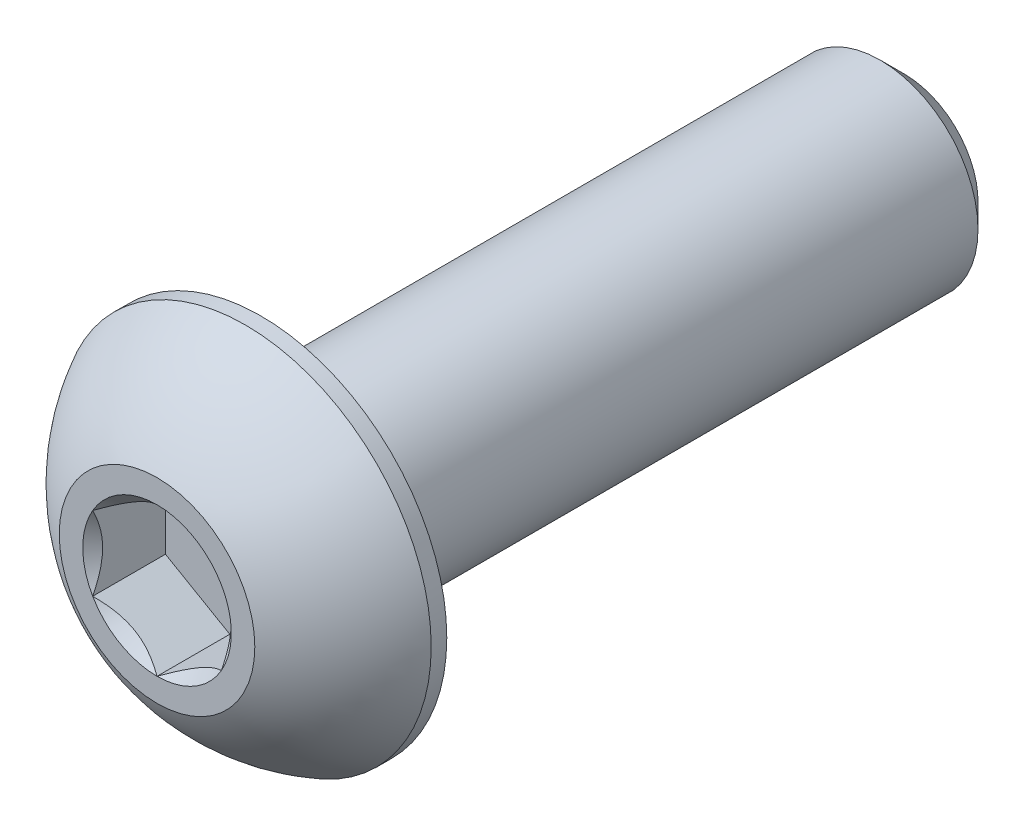
ISO-10303-21;
HEADER;
FILE_DESCRIPTION(('STEP AP214'),'2;1');
FILE_NAME('part.step','',(''),(''),'','','');
FILE_SCHEMA(('AUTOMOTIVE_DESIGN { 1 0 10303 214 1 1 1 1 }'));
ENDSEC;
DATA;
#1=APPLICATION_CONTEXT('core data for automotive mechanical design processes');
#2=APPLICATION_PROTOCOL_DEFINITION('international standard','automotive_design',2000,#1);
#3=PRODUCT_CONTEXT('',#1,'mechanical');
#4=PRODUCT('Part','Part','',(#3));
#5=PRODUCT_RELATED_PRODUCT_CATEGORY('part','',(#4));
#6=PRODUCT_DEFINITION_FORMATION('','',#4);
#7=PRODUCT_DEFINITION_CONTEXT('part definition',#1,'design');
#8=PRODUCT_DEFINITION('design','',#6,#7);
#9=PRODUCT_DEFINITION_SHAPE('','',#8);
#10=(LENGTH_UNIT() NAMED_UNIT(*) SI_UNIT(.MILLI.,.METRE.));
#11=(NAMED_UNIT(*) PLANE_ANGLE_UNIT() SI_UNIT($,.RADIAN.));
#12=(NAMED_UNIT(*) SI_UNIT($,.STERADIAN.) SOLID_ANGLE_UNIT());
#13=UNCERTAINTY_MEASURE_WITH_UNIT(LENGTH_MEASURE(1.E-05),#10,'distance_accuracy_value','');
#14=(GEOMETRIC_REPRESENTATION_CONTEXT(3) GLOBAL_UNCERTAINTY_ASSIGNED_CONTEXT((#13)) GLOBAL_UNIT_ASSIGNED_CONTEXT((#10,
#11,#12)) REPRESENTATION_CONTEXT('',''));
#15=CARTESIAN_POINT('',(0.,0.,0.));
#16=DIRECTION('',(0.,0.,1.));
#17=DIRECTION('',(1.,0.,0.));
#18=AXIS2_PLACEMENT_3D('',#15,#16,#17);
#19=CARTESIAN_POINT('',(0.,-2.41300000000001,-18.4404));
#20=DIRECTION('',(0.,0.,-1.));
#21=DIRECTION('',(0.,1.,0.));
#22=AXIS2_PLACEMENT_3D('',#19,#20,#21);
#23=PLANE('',#22);
#24=CARTESIAN_POINT('',(0.,0.,-18.4404));
#25=DIRECTION('',(0.,0.,-1.));
#26=DIRECTION('',(0.,1.,0.));
#27=AXIS2_PLACEMENT_3D('',#24,#25,#26);
#28=CIRCLE('',#27,1.8176875);
#29=CARTESIAN_POINT('',(0.,1.8176875,-18.4404));
#30=VERTEX_POINT('',#29);
#31=EDGE_CURVE('E42',#30,#30,#28,.T.);
#32=ORIENTED_EDGE('',*,*,#31,.T.);
#33=EDGE_LOOP('',(#32));
#34=FACE_BOUND('',#33,.T.);
#35=ADVANCED_FACE('F34',(#34),#23,.T.);
#36=CARTESIAN_POINT('',(0.,0.,-18.4404));
#37=DIRECTION('',(0.,0.,-1.));
#38=DIRECTION('',(0.,1.,0.));
#39=AXIS2_PLACEMENT_3D('',#36,#37,#38);
#40=CYLINDRICAL_SURFACE('',#39,2.413);
#41=CARTESIAN_POINT('',(0.,0.,-17.8450875));
#42=DIRECTION('',(0.,0.,-1.));
#43=DIRECTION('',(0.,1.,0.));
#44=AXIS2_PLACEMENT_3D('',#41,#42,#43);
#45=CIRCLE('',#44,2.413);
#46=CARTESIAN_POINT('',(0.,2.413,-17.8450875));
#47=VERTEX_POINT('',#46);
#48=EDGE_CURVE('E11',#47,#47,#45,.F.);
#49=ORIENTED_EDGE('',*,*,#48,.T.);
#50=EDGE_LOOP('',(#49));
#51=FACE_BOUND('',#50,.T.);
#52=CARTESIAN_POINT('',(0.,0.,-2.5654));
#53=DIRECTION('',(0.,0.,1.));
#54=DIRECTION('',(1.,0.,0.));
#55=AXIS2_PLACEMENT_3D('',#52,#53,#54);
#56=CIRCLE('',#55,2.413);
#57=CARTESIAN_POINT('',(2.413,0.,-2.5654));
#58=VERTEX_POINT('',#57);
#59=EDGE_CURVE('E168',#58,#58,#56,.F.);
#60=ORIENTED_EDGE('',*,*,#59,.T.);
#61=EDGE_LOOP('',(#60));
#62=FACE_BOUND('',#61,.T.);
#63=ADVANCED_FACE('F176',(#51,#62),#40,.T.);
#64=CARTESIAN_POINT('',(0.,0.,-18.4404));
#65=DIRECTION('',(0.,0.,1.));
#66=DIRECTION('',(0.,-1.,0.));
#67=AXIS2_PLACEMENT_3D('',#64,#65,#66);
#68=CONICAL_SURFACE('',#67,1.8176875,0.785398163397443);
#69=ORIENTED_EDGE('',*,*,#48,.F.);
#70=EDGE_LOOP('',(#69));
#71=FACE_BOUND('',#70,.T.);
#72=ORIENTED_EDGE('',*,*,#31,.F.);
#73=EDGE_LOOP('',(#72));
#74=FACE_BOUND('',#73,.T.);
#75=ADVANCED_FACE('F36',(#71,#74),#68,.T.);
#76=CARTESIAN_POINT('',(0.,0.,-4.5748806144438));
#77=DIRECTION('',(0.,0.,1.));
#78=DIRECTION('',(0.,-1.,0.));
#79=AXIS2_PLACEMENT_3D('',#76,#77,#78);
#80=SPHERICAL_SURFACE('',#79,5.17224338526463);
#81=CARTESIAN_POINT('',(0.,0.,0.));
#82=DIRECTION('',(0.,0.,1.));
#83=DIRECTION('',(1.,0.,0.));
#84=AXIS2_PLACEMENT_3D('',#81,#82,#83);
#85=CIRCLE('',#84,2.413);
#86=CARTESIAN_POINT('',(0.,-2.413,0.));
#87=VERTEX_POINT('',#86);
#88=EDGE_CURVE('E165',#87,#87,#85,.T.);
#89=CARTESIAN_POINT('',(0.,0.,-2.18059));
#90=DIRECTION('',(0.,0.,1.));
#91=DIRECTION('',(1.,0.,0.));
#92=AXIS2_PLACEMENT_3D('',#89,#90,#91);
#93=CIRCLE('',#92,4.5847);
#94=CARTESIAN_POINT('',(0.,-4.5847,-2.18059));
#95=VERTEX_POINT('',#94);
#96=EDGE_CURVE('E159',#95,#95,#93,.T.);
#97=CARTESIAN_POINT('',(0.,-2.413,0.));
#98=CARTESIAN_POINT('',(0.,-2.44179113663083,-0.0151857097788009));
#99=CARTESIAN_POINT('',(0.,-2.47043888331474,-0.0306432741933343));
#100=CARTESIAN_POINT('',(0.,-2.5274374690351,-0.0620964513369402));
#101=CARTESIAN_POINT('',(0.,-2.55578830807155,-0.0780920640660127));
#102=CARTESIAN_POINT('',(0.,-2.61218295074331,-0.110615676881771));
#103=CARTESIAN_POINT('',(0.,-2.64022675437863,-0.127143676968457));
#104=CARTESIAN_POINT('',(0.,-2.69599733629138,-0.160726162390165));
#105=CARTESIAN_POINT('',(0.,-2.72372411456883,-0.177780647725188));
#106=CARTESIAN_POINT('',(0.,-2.77885076121155,-0.21241002764294));
#107=CARTESIAN_POINT('',(0.,-2.80625062957682,-0.229984922225668));
#108=CARTESIAN_POINT('',(0.,-2.86071369040082,-0.265648855453746));
#109=CARTESIAN_POINT('',(0.,-2.88777688285954,-0.283737894099096));
#110=CARTESIAN_POINT('',(0.,-2.94155694533546,-0.320423667994127));
#111=CARTESIAN_POINT('',(0.,-2.96827381535266,-0.339020403243808));
#112=CARTESIAN_POINT('',(0.,-3.02135171000009,-0.37671494166065));
#113=CARTESIAN_POINT('',(0.,-3.04771273463033,-0.39581274482781));
#114=CARTESIAN_POINT('',(0.,-3.10006954235699,-0.434502611862808));
#115=CARTESIAN_POINT('',(0.,-3.12606532545341,-0.454094675730644));
#116=CARTESIAN_POINT('',(0.,-3.17768238416296,-0.493766080756604));
#117=CARTESIAN_POINT('',(0.,-3.20330365977609,-0.513845421914727));
#118=CARTESIAN_POINT('',(0.,-3.25416257105645,-0.554484224430573));
#119=CARTESIAN_POINT('',(0.,-3.27940020672367,-0.575043685788297));
#120=CARTESIAN_POINT('',(0.,-3.32948284239517,-0.616635400476975));
#121=CARTESIAN_POINT('',(0.,-3.35432784239946,-0.63766765380793));
#122=CARTESIAN_POINT('',(0.,-3.40361635097913,-0.680197455694829));
#123=CARTESIAN_POINT('',(0.,-3.42805985955453,-0.701695004250773));
#124=CARTESIAN_POINT('',(0.,-3.47653667261836,-0.745147733989217));
#125=CARTESIAN_POINT('',(0.,-3.5005699771068,-0.767102915171716));
#126=CARTESIAN_POINT('',(0.,-3.54821781555203,-0.81146308444603));
#127=CARTESIAN_POINT('',(0.,-3.57183234950881,-0.833868072537843));
#128=CARTESIAN_POINT('',(0.,-3.61863422971284,-0.879119869584105));
#129=CARTESIAN_POINT('',(0.,-3.64182157596008,-0.901966678538555));
#130=CARTESIAN_POINT('',(0.,-3.68776081583415,-0.948093973780533));
#131=CARTESIAN_POINT('',(0.,-3.71051270946098,-0.971374460068061));
#132=CARTESIAN_POINT('',(0.,-3.75557293439636,-1.01836081186645));
#133=CARTESIAN_POINT('',(0.,-3.7778812657049,-1.0420666773773));
#134=CARTESIAN_POINT('',(0.,-3.82204641440941,-1.08989533789018));
#135=CARTESIAN_POINT('',(0.,-3.84390323180538,-1.11401813289221));
#136=CARTESIAN_POINT('',(0.,-3.88715756202836,-1.16267205404467));
#137=CARTESIAN_POINT('',(0.,-3.90855507485536,-1.18720318019511));
#138=CARTESIAN_POINT('',(0.,-3.95088316899876,-1.23666501975588));
#139=CARTESIAN_POINT('',(0.,-3.97181375031515,-1.26159573316622));
#140=CARTESIAN_POINT('',(0.,-4.01320052092912,-1.31184786092909));
#141=CARTESIAN_POINT('',(0.,-4.03365671022669,-1.33716927528163));
#142=CARTESIAN_POINT('',(0.,-4.07408740538699,-1.38819377934977));
#143=CARTESIAN_POINT('',(0.,-4.09406191124973,-1.41389686906536));
#144=CARTESIAN_POINT('',(0.,-4.13352211981722,-1.46567556223513));
#145=CARTESIAN_POINT('',(0.,-4.15300782252198,-1.4917511656893));
#146=CARTESIAN_POINT('',(0.,-4.19148347927457,-1.54426559193551));
#147=CARTESIAN_POINT('',(0.,-4.2104734333224,-1.57070441472756));
#148=CARTESIAN_POINT('',(0.,-4.24795082398615,-1.6239358557723));
#149=CARTESIAN_POINT('',(0.,-4.26643826060207,-1.65072847402499));
#150=CARTESIAN_POINT('',(0.,-4.30290402667351,-1.70465795604563));
#151=CARTESIAN_POINT('',(0.,-4.32088235612901,-1.73179481981358));
#152=CARTESIAN_POINT('',(0.,-4.35632349988304,-1.78640312007115));
#153=CARTESIAN_POINT('',(0.,-4.37378631418156,-1.81387455656079));
#154=CARTESIAN_POINT('',(0.,-4.40819020238474,-1.86914221075438));
#155=CARTESIAN_POINT('',(0.,-4.42513127628939,-1.89693842845834));
#156=CARTESIAN_POINT('',(0.,-4.45848564813517,-1.95284573578717));
#157=CARTESIAN_POINT('',(0.,-4.4748989460763,-1.98095682541204));
#158=CARTESIAN_POINT('',(0.,-4.50719190474587,-2.03748386259807));
#159=CARTESIAN_POINT('',(0.,-4.5230715654743,-2.06589981015923));
#160=CARTESIAN_POINT('',(0.,-4.55429163018258,-2.12302641242262));
#161=CARTESIAN_POINT('',(0.,-4.56963203416241,-2.15173706712485));
#162=CARTESIAN_POINT('',(0.,-4.5847,-2.18059));
#163=B_SPLINE_CURVE_WITH_KNOTS('',3,(#97,#98,#99,#100,#101,#102,#103,#104,#105,#106,#107,#108,
#109,#110,#111,#112,#113,#114,#115,#116,#117,#118,#119,#120,#121,#122,#123,#124,#125,#126,#127,
#128,#129,#130,#131,#132,#133,#134,#135,#136,#137,#138,#139,#140,#141,#142,#143,#144,#145,#146,
#147,#148,#149,#150,#151,#152,#153,#154,#155,#156,#157,#158,#159,#160,#161,#162),.UNSPECIFIED.,
.F.,.F.,(4,2,2,2,2,2,2,2,2,2,2,2,2,2,2,2,2,2,2,2,2,2,2,2,2,2,2,2,2,2,2,2,4),(0.,
0.0976500604051489,0.195300120810298,0.292950181215447,0.390600241620598,0.488250302025747,
0.585900362430896,0.683550422836046,0.781200483241194,0.878850543646344,0.976500604051493,
1.07415066445664,1.17180072486179,1.26945078526694,1.36710084567209,1.46475090607724,
1.56240096648239,1.66005102688754,1.75770108729269,1.85535114769784,1.95300120810299,
2.05065126850813,2.14830132891329,2.24595138931843,2.34360144972358,2.44125151012873,
2.53890157053388,2.63655163093903,2.73420169134418,2.83185175174933,2.92950181215448,
3.02715187255963,3.12480193296478),.UNSPECIFIED.);
#164=EDGE_CURVE('BSEAM175',#87,#95,#163,.T.);
#165=ORIENTED_EDGE('',*,*,#88,.F.);
#166=ORIENTED_EDGE('',*,*,#96,.T.);
#167=ORIENTED_EDGE('',*,*,#164,.T.);
#168=ORIENTED_EDGE('',*,*,#164,.F.);
#169=EDGE_LOOP('',(#165,#167,#166,#168));
#170=FACE_BOUND('',#169,.T.);
#171=ADVANCED_FACE('F175',(#170),#80,.T.);
#172=CARTESIAN_POINT('',(0.,-2.413,0.));
#173=DIRECTION('',(0.,0.,-1.));
#174=DIRECTION('',(-1.,0.,0.));
#175=AXIS2_PLACEMENT_3D('',#172,#173,#174);
#176=PLANE('',#175);
#177=CARTESIAN_POINT('',(0.,0.,0.));
#178=DIRECTION('',(0.,0.,1.));
#179=DIRECTION('',(1.,0.,0.));
#180=AXIS2_PLACEMENT_3D('',#177,#178,#179);
#181=CIRCLE('',#180,1.83308710467706);
#182=CARTESIAN_POINT('',(-1.5875,0.91654355233853,0.));
#183=VERTEX_POINT('',#182);
#184=CARTESIAN_POINT('',(-1.5875,-0.916543552338532,0.));
#185=VERTEX_POINT('',#184);
#186=EDGE_CURVE('E55',#183,#185,#181,.T.);
#187=ORIENTED_EDGE('',*,*,#186,.F.);
#188=CARTESIAN_POINT('',(0.,1.83308710467706,0.));
#189=VERTEX_POINT('',#188);
#190=EDGE_CURVE('E129',#189,#183,#181,.T.);
#191=ORIENTED_EDGE('',*,*,#190,.F.);
#192=CARTESIAN_POINT('',(1.5875,0.916543552338531,0.));
#193=VERTEX_POINT('',#192);
#194=EDGE_CURVE('E106',#193,#189,#181,.T.);
#195=ORIENTED_EDGE('',*,*,#194,.F.);
#196=CARTESIAN_POINT('',(1.5875,-0.916543552338531,0.));
#197=VERTEX_POINT('',#196);
#198=EDGE_CURVE('E95',#197,#193,#181,.T.);
#199=ORIENTED_EDGE('',*,*,#198,.F.);
#200=CARTESIAN_POINT('',(0.,-1.83308710467706,0.));
#201=VERTEX_POINT('',#200);
#202=EDGE_CURVE('E87',#201,#197,#181,.T.);
#203=ORIENTED_EDGE('',*,*,#202,.F.);
#204=EDGE_CURVE('E48',#185,#201,#181,.T.);
#205=ORIENTED_EDGE('',*,*,#204,.F.);
#206=EDGE_LOOP('',(#187,#191,#195,#199,#203,#205));
#207=FACE_BOUND('',#206,.T.);
#208=ORIENTED_EDGE('',*,*,#88,.T.);
#209=EDGE_LOOP('',(#208));
#210=FACE_BOUND('',#209,.T.);
#211=ADVANCED_FACE('F126',(#207,#210),#176,.F.);
#212=CARTESIAN_POINT('',(0.,-4.5847,-2.5654));
#213=DIRECTION('',(0.,0.,1.));
#214=DIRECTION('',(1.,0.,0.));
#215=AXIS2_PLACEMENT_3D('',#212,#213,#214);
#216=PLANE('',#215);
#217=ORIENTED_EDGE('',*,*,#59,.F.);
#218=EDGE_LOOP('',(#217));
#219=FACE_BOUND('',#218,.T.);
#220=CARTESIAN_POINT('',(0.,0.,-2.5654));
#221=DIRECTION('',(0.,0.,1.));
#222=DIRECTION('',(1.,0.,0.));
#223=AXIS2_PLACEMENT_3D('',#220,#221,#222);
#224=CIRCLE('',#223,4.5847);
#225=CARTESIAN_POINT('',(4.5847,0.,-2.5654));
#226=VERTEX_POINT('',#225);
#227=EDGE_CURVE('E162',#226,#226,#224,.T.);
#228=ORIENTED_EDGE('',*,*,#227,.F.);
#229=EDGE_LOOP('',(#228));
#230=FACE_BOUND('',#229,.T.);
#231=ADVANCED_FACE('F193',(#219,#230),#216,.F.);
#232=CARTESIAN_POINT('',(0.,0.,0.));
#233=DIRECTION('',(0.,0.,1.));
#234=DIRECTION('',(1.,0.,0.));
#235=AXIS2_PLACEMENT_3D('',#232,#233,#234);
#236=CYLINDRICAL_SURFACE('',#235,4.5847);
#237=ORIENTED_EDGE('',*,*,#96,.F.);
#238=EDGE_LOOP('',(#237));
#239=FACE_BOUND('',#238,.T.);
#240=ORIENTED_EDGE('',*,*,#227,.T.);
#241=EDGE_LOOP('',(#240));
#242=FACE_BOUND('',#241,.T.);
#243=ADVANCED_FACE('F196',(#239,#242),#236,.T.);
#244=CARTESIAN_POINT('',(0.,0.,0.));
#245=DIRECTION('',(0.,0.,1.));
#246=DIRECTION('',(1.,0.,0.));
#247=AXIS2_PLACEMENT_3D('',#244,#245,#246);
#248=CONICAL_SURFACE('',#247,1.83308710467706,0.78539816339745);
#249=ORIENTED_EDGE('',*,*,#198,.T.);
#250=CARTESIAN_POINT('',(1.5875,-1.83163614232864,0.590762562254563));
#251=CARTESIAN_POINT('',(1.5875,-1.78705354844902,0.557077854803239));
#252=CARTESIAN_POINT('',(1.5875,-1.74222294150554,0.523722329968626));
#253=CARTESIAN_POINT('',(1.5875,-1.65196486784504,0.457805675888284));
#254=CARTESIAN_POINT('',(1.5875,-1.60653725449664,0.425244747634467));
#255=CARTESIAN_POINT('',(1.5875,-1.46854281940082,0.328493449461235));
#256=CARTESIAN_POINT('',(1.5875,-1.37494211623385,0.265753264612857));
#257=CARTESIAN_POINT('',(1.5875,-1.17864136265694,0.142553151294644));
#258=CARTESIAN_POINT('',(1.5875,-1.07572731596385,0.0824303289226483));
#259=CARTESIAN_POINT('',(1.5875,-0.864754189558117,-0.0275706334490083));
#260=CARTESIAN_POINT('',(1.5875,-0.756714033301438,-0.0774833149376717));
#261=CARTESIAN_POINT('',(1.5875,-0.594580029688666,-0.138547963751185));
#262=CARTESIAN_POINT('',(1.5875,-0.542894373932897,-0.156067797502568));
#263=CARTESIAN_POINT('',(1.5875,-0.43827206291756,-0.186958420156953));
#264=CARTESIAN_POINT('',(1.5875,-0.3853353220534,-0.200328924255393));
#265=CARTESIAN_POINT('',(1.5875,-0.279413400734369,-0.222002681044568));
#266=CARTESIAN_POINT('',(1.5875,-0.226446313904206,-0.230392976800141));
#267=CARTESIAN_POINT('',(1.5875,-0.119941637592404,-0.241941911012322));
#268=CARTESIAN_POINT('',(1.5875,-0.066404148626323,-0.245101456366562));
#269=CARTESIAN_POINT('',(1.5875,0.0387581192420282,-0.245952982965122));
#270=CARTESIAN_POINT('',(1.5875,0.0903813815542163,-0.243840334608509));
#271=CARTESIAN_POINT('',(1.5875,0.19318730201683,-0.234695846678065));
#272=CARTESIAN_POINT('',(1.5875,0.244369916988517,-0.227663530460197));
#273=CARTESIAN_POINT('',(1.5875,0.346790527788956,-0.208944949355169));
#274=CARTESIAN_POINT('',(1.5875,0.398013804172139,-0.197179358640977));
#275=CARTESIAN_POINT('',(1.5875,0.499340680307277,-0.169620657149212));
#276=CARTESIAN_POINT('',(1.5875,0.549444372105894,-0.153827878801824));
#277=CARTESIAN_POINT('',(1.5875,0.707022639586408,-0.0982133790717419));
#278=CARTESIAN_POINT('',(1.5875,0.812258737570578,-0.0520647672653369));
#279=CARTESIAN_POINT('',(1.5875,1.01778869013701,0.0505458403808824));
#280=CARTESIAN_POINT('',(1.5875,1.11806310933257,0.107044855107553));
#281=CARTESIAN_POINT('',(1.5875,1.30970442577157,0.223612502972616));
#282=CARTESIAN_POINT('',(1.5875,1.40126637149297,0.283364441978613));
#283=CARTESIAN_POINT('',(1.5875,1.53616443073865,0.37573700869171));
#284=CARTESIAN_POINT('',(1.5875,1.58054835823549,0.406854014274728));
#285=CARTESIAN_POINT('',(1.5875,1.66870952512132,0.469911550181166));
#286=CARTESIAN_POINT('',(1.5875,1.71248692801697,0.501851851647461));
#287=CARTESIAN_POINT('',(1.5875,1.75601179240957,0.53413355784713));
#288=B_SPLINE_CURVE_WITH_KNOTS('',3,(#250,#251,#252,#253,#254,#255,#256,#257,#258,#259,#260,
#261,#262,#263,#264,#265,#266,#267,#268,#269,#270,#271,#272,#273,#274,#275,#276,#277,#278,#279,
#280,#281,#282,#283,#284,#285,#286,#287),.UNSPECIFIED.,.F.,.F.,(4,2,2,2,2,2,2,2,2,2,2,2,2,2,2,2,
2,2,4),(0.,0.167627505127548,0.335296980846479,0.673194674702937,1.0304700708717,
1.38651603079307,1.55010049300857,1.71369618096554,1.87434127467533,2.034958513124,
2.18971280484453,2.34448209207484,2.50196108385089,2.65942708049529,3.00314617711216,
3.34811949873714,3.67595792169729,3.83856722085481,4.00113179576279),.UNSPECIFIED.);
#289=EDGE_CURVE('E100',#197,#193,#288,.T.);
#290=ORIENTED_EDGE('',*,*,#289,.F.);
#291=EDGE_LOOP('',(#249,#290));
#292=FACE_BOUND('',#291,.T.);
#293=ADVANCED_FACE('F101',(#292),#248,.F.);
#294=ORIENTED_EDGE('',*,*,#194,.T.);
#295=CARTESIAN_POINT('',(1.5877,0.916428082284693,0.000115480963706747));
#296=CARTESIAN_POINT('',(1.53312479190086,0.947937093371809,-0.0313691916294031));
#297=CARTESIAN_POINT('',(1.47763696320971,0.979973006203395,-0.06100495398647));
#298=CARTESIAN_POINT('',(1.36449087915364,1.04529792829092,-0.115267739979175));
#299=CARTESIAN_POINT('',(1.30682185887062,1.07859315267522,-0.139864564866823));
#300=CARTESIAN_POINT('',(1.1905349781269,1.14573141457583,-0.181999635727418));
#301=CARTESIAN_POINT('',(1.13194674474407,1.17955734689075,-0.199643807270178));
#302=CARTESIAN_POINT('',(1.01348022674557,1.24795402294714,-0.226828529915031));
#303=CARTESIAN_POINT('',(0.953605562983895,1.28252267618758,-0.236389379304923));
#304=CARTESIAN_POINT('',(0.850418771876558,1.34209759781022,-0.245015586895992));
#305=CARTESIAN_POINT('',(0.807240015952288,1.36702686416637,-0.246292807190424));
#306=CARTESIAN_POINT('',(0.720953038535399,1.41684467380557,-0.244142944185295));
#307=CARTESIAN_POINT('',(0.677844847078612,1.44173319974742,-0.240714211450657));
#308=CARTESIAN_POINT('',(0.592046335002031,1.49126899379091,-0.229349005566657));
#309=CARTESIAN_POINT('',(0.549356408925407,1.51591603410293,-0.221408628198358));
#310=CARTESIAN_POINT('',(0.464693063478359,1.56479643938728,-0.201451585548899));
#311=CARTESIAN_POINT('',(0.422719959755075,1.58902962212064,-0.189433170791309));
#312=CARTESIAN_POINT('',(0.315211458113567,1.65109968448354,-0.153753102752754));
#313=CARTESIAN_POINT('',(0.2503427717089,1.68855163804125,-0.127401427696863));
#314=CARTESIAN_POINT('',(0.154961599380924,1.74361998356043,-0.082916463148298));
#315=CARTESIAN_POINT('',(0.123530699536157,1.76176662204668,-0.0672871421988685));
#316=CARTESIAN_POINT('',(0.0612469855696369,1.79772614107138,-0.0346015121388986));
#317=CARTESIAN_POINT('',(0.0303939039605764,1.8155391760437,-0.0175458843430301));
#318=CARTESIAN_POINT('',(-0.000200000000000335,1.8332025747309,0.000115480963706747));
#319=B_SPLINE_CURVE_WITH_KNOTS('',3,(#295,#296,#297,#298,#299,#300,#301,#302,#303,#304,#305,
#306,#307,#308,#309,#310,#311,#312,#313,#314,#315,#316,#317,#318),.UNSPECIFIED.,.F.,.F.,(4,2,2,
2,2,2,2,2,2,2,2,4),(0.,0.211482650810816,0.424197870807276,0.633533884524815,0.842342653263347,
0.99175555372714,1.14122083674204,1.29081565918877,1.44047473906437,1.6781878086972,
1.79671410024894,1.91518409436631),.UNSPECIFIED.);
#320=EDGE_CURVE('E105',#193,#189,#319,.T.);
#321=ORIENTED_EDGE('',*,*,#320,.F.);
#322=EDGE_LOOP('',(#294,#321));
#323=FACE_BOUND('',#322,.T.);
#324=ADVANCED_FACE('F287',(#323),#248,.F.);
#325=ORIENTED_EDGE('',*,*,#190,.T.);
#326=CARTESIAN_POINT('',(0.000199999999999612,1.8332025747309,0.000115480963706835));
#327=CARTESIAN_POINT('',(-0.0543752080991368,1.80169356364378,-0.0313691916294032));
#328=CARTESIAN_POINT('',(-0.10986303679029,1.7696576508122,-0.0610049539864702));
#329=CARTESIAN_POINT('',(-0.223009120846359,1.70433272872467,-0.115267739979175));
#330=CARTESIAN_POINT('',(-0.280678141129382,1.67103750434037,-0.139864564866824));
#331=CARTESIAN_POINT('',(-0.396965021873104,1.60389924243976,-0.181999635727418));
#332=CARTESIAN_POINT('',(-0.455553255255932,1.57007331012484,-0.199643807270178));
#333=CARTESIAN_POINT('',(-0.574019773254431,1.50167663406845,-0.226828529915032));
#334=CARTESIAN_POINT('',(-0.633894437016106,1.46710798082801,-0.236389379304923));
#335=CARTESIAN_POINT('',(-0.737081228123443,1.40753305920537,-0.245015586895992));
#336=CARTESIAN_POINT('',(-0.780259984047713,1.38260379284922,-0.246292807190424));
#337=CARTESIAN_POINT('',(-0.866546961464602,1.33278598321002,-0.244142944185296));
#338=CARTESIAN_POINT('',(-0.909655152921389,1.30789745726817,-0.240714211450657));
#339=CARTESIAN_POINT('',(-0.99545366499797,1.25836166322468,-0.229349005566657));
#340=CARTESIAN_POINT('',(-1.03814359107459,1.23371462291266,-0.221408628198358));
#341=CARTESIAN_POINT('',(-1.12280693652164,1.18483421762831,-0.201451585548898));
#342=CARTESIAN_POINT('',(-1.16478004024493,1.16060103489495,-0.189433170791309));
#343=CARTESIAN_POINT('',(-1.27228854188643,1.09853097253205,-0.153753102752754));
#344=CARTESIAN_POINT('',(-1.3371572282911,1.06107901897434,-0.127401427696863));
#345=CARTESIAN_POINT('',(-1.43253840061908,1.00601067345516,-0.0829164631482979));
#346=CARTESIAN_POINT('',(-1.46396930046384,0.987864034968914,-0.0672871421988685));
#347=CARTESIAN_POINT('',(-1.52625301443036,0.951904515944214,-0.0346015121388987));
#348=CARTESIAN_POINT('',(-1.55710609603942,0.934091480971893,-0.0175458843430304));
#349=CARTESIAN_POINT('',(-1.5877,0.916428082284693,0.000115480963706349));
#350=B_SPLINE_CURVE_WITH_KNOTS('',3,(#326,#327,#328,#329,#330,#331,#332,#333,#334,#335,#336,
#337,#338,#339,#340,#341,#342,#343,#344,#345,#346,#347,#348,#349),.UNSPECIFIED.,.F.,.F.,(4,2,2,
2,2,2,2,2,2,2,2,4),(0.,0.211482650810817,0.424197870807276,0.633533884524816,0.842342653263349,
0.991755553727142,1.14122083674205,1.29081565918877,1.44047473906438,1.6781878086972,
1.79671410024894,1.91518409436631),.UNSPECIFIED.);
#351=EDGE_CURVE('E136',#189,#183,#350,.T.);
#352=ORIENTED_EDGE('',*,*,#351,.F.);
#353=EDGE_LOOP('',(#325,#352));
#354=FACE_BOUND('',#353,.T.);
#355=ADVANCED_FACE('F134',(#354),#248,.F.);
#356=ORIENTED_EDGE('',*,*,#186,.T.);
#357=CARTESIAN_POINT('',(-1.5875,-1.83163614232865,0.590762562254564));
#358=CARTESIAN_POINT('',(-1.5875,-1.78705354844902,0.55707785480324));
#359=CARTESIAN_POINT('',(-1.5875,-1.74222294150555,0.523722329968627));
#360=CARTESIAN_POINT('',(-1.5875,-1.65196486784504,0.457805675888285));
#361=CARTESIAN_POINT('',(-1.5875,-1.60653725449665,0.425244747634468));
#362=CARTESIAN_POINT('',(-1.5875,-1.46854281940082,0.328493449461235));
#363=CARTESIAN_POINT('',(-1.5875,-1.37494211623386,0.265753264612857));
#364=CARTESIAN_POINT('',(-1.5875,-1.17864136265695,0.142553151294644));
#365=CARTESIAN_POINT('',(-1.5875,-1.07572731596385,0.0824303289226481));
#366=CARTESIAN_POINT('',(-1.5875,-0.864754189558117,-0.0275706334490085));
#367=CARTESIAN_POINT('',(-1.5875,-0.756714033301438,-0.0774833149376719));
#368=CARTESIAN_POINT('',(-1.5875,-0.594580029688666,-0.138547963751186));
#369=CARTESIAN_POINT('',(-1.5875,-0.542894373932898,-0.156067797502569));
#370=CARTESIAN_POINT('',(-1.5875,-0.43827206291756,-0.186958420156954));
#371=CARTESIAN_POINT('',(-1.5875,-0.3853353220534,-0.200328924255393));
#372=CARTESIAN_POINT('',(-1.5875,-0.27941340073437,-0.222002681044568));
#373=CARTESIAN_POINT('',(-1.5875,-0.226446313904207,-0.230392976800141));
#374=CARTESIAN_POINT('',(-1.5875,-0.119941637592404,-0.241941911012323));
#375=CARTESIAN_POINT('',(-1.5875,-0.0664041486263238,-0.245101456366563));
#376=CARTESIAN_POINT('',(-1.5875,0.0387581192420274,-0.245952982965122));
#377=CARTESIAN_POINT('',(-1.5875,0.0903813815542155,-0.24384033460851));
#378=CARTESIAN_POINT('',(-1.5875,0.193187302016829,-0.234695846678065));
#379=CARTESIAN_POINT('',(-1.5875,0.244369916988516,-0.227663530460198));
#380=CARTESIAN_POINT('',(-1.5875,0.346790527788956,-0.208944949355169));
#381=CARTESIAN_POINT('',(-1.5875,0.398013804172139,-0.197179358640978));
#382=CARTESIAN_POINT('',(-1.5875,0.499340680307276,-0.169620657149213));
#383=CARTESIAN_POINT('',(-1.5875,0.549444372105894,-0.153827878801825));
#384=CARTESIAN_POINT('',(-1.5875,0.707022639586407,-0.0982133790717423));
#385=CARTESIAN_POINT('',(-1.5875,0.812258737570578,-0.0520647672653373));
#386=CARTESIAN_POINT('',(-1.5875,1.01778869013701,0.0505458403808818));
#387=CARTESIAN_POINT('',(-1.5875,1.11806310933256,0.107044855107552));
#388=CARTESIAN_POINT('',(-1.5875,1.30970442577157,0.223612502972616));
#389=CARTESIAN_POINT('',(-1.5875,1.40126637149297,0.283364441978612));
#390=CARTESIAN_POINT('',(-1.5875,1.53616443073864,0.375737008691709));
#391=CARTESIAN_POINT('',(-1.5875,1.58054835823549,0.406854014274728));
#392=CARTESIAN_POINT('',(-1.5875,1.66870952512132,0.469911550181165));
#393=CARTESIAN_POINT('',(-1.5875,1.71248692801697,0.501851851647461));
#394=CARTESIAN_POINT('',(-1.5875,1.75601179240957,0.53413355784713));
#395=B_SPLINE_CURVE_WITH_KNOTS('',3,(#357,#358,#359,#360,#361,#362,#363,#364,#365,#366,#367,
#368,#369,#370,#371,#372,#373,#374,#375,#376,#377,#378,#379,#380,#381,#382,#383,#384,#385,#386,
#387,#388,#389,#390,#391,#392,#393,#394),.UNSPECIFIED.,.F.,.F.,(4,2,2,2,2,2,2,2,2,2,2,2,2,2,2,2,
2,2,4),(0.,0.167627505127548,0.33529698084648,0.673194674702938,1.0304700708717,
1.38651603079307,1.55010049300858,1.71369618096554,1.87434127467533,2.034958513124,
2.18971280484453,2.34448209207484,2.50196108385089,2.65942708049529,3.00314617711216,
3.34811949873714,3.6759579216973,3.83856722085481,4.00113179576279),.UNSPECIFIED.);
#396=EDGE_CURVE('E140',#183,#185,#395,.F.);
#397=ORIENTED_EDGE('',*,*,#396,.F.);
#398=EDGE_LOOP('',(#356,#397));
#399=FACE_BOUND('',#398,.T.);
#400=ADVANCED_FACE('F281',(#399),#248,.F.);
#401=ORIENTED_EDGE('',*,*,#204,.T.);
#402=CARTESIAN_POINT('',(-1.5877,-0.916428082284693,0.000115480963706314));
#403=CARTESIAN_POINT('',(-1.53312479190086,-0.947937093371809,-0.0313691916294035));
#404=CARTESIAN_POINT('',(-1.47763696320971,-0.979973006203395,-0.0610049539864703));
#405=CARTESIAN_POINT('',(-1.36449087915364,-1.04529792829092,-0.115267739979175));
#406=CARTESIAN_POINT('',(-1.30682185887062,-1.07859315267522,-0.139864564866824));
#407=CARTESIAN_POINT('',(-1.1905349781269,-1.14573141457583,-0.181999635727418));
#408=CARTESIAN_POINT('',(-1.13194674474407,-1.17955734689075,-0.199643807270178));
#409=CARTESIAN_POINT('',(-1.01348022674557,-1.24795402294714,-0.226828529915032));
#410=CARTESIAN_POINT('',(-0.953605562983895,-1.28252267618758,-0.236389379304923));
#411=CARTESIAN_POINT('',(-0.850418771876558,-1.34209759781022,-0.245015586895992));
#412=CARTESIAN_POINT('',(-0.807240015952288,-1.36702686416637,-0.246292807190424));
#413=CARTESIAN_POINT('',(-0.720953038535399,-1.41684467380557,-0.244142944185296));
#414=CARTESIAN_POINT('',(-0.677844847078612,-1.44173319974742,-0.240714211450657));
#415=CARTESIAN_POINT('',(-0.592046335002031,-1.49126899379091,-0.229349005566657));
#416=CARTESIAN_POINT('',(-0.549356408925407,-1.51591603410293,-0.221408628198359));
#417=CARTESIAN_POINT('',(-0.464693063478359,-1.56479643938728,-0.201451585548899));
#418=CARTESIAN_POINT('',(-0.422719959755075,-1.58902962212064,-0.18943317079131));
#419=CARTESIAN_POINT('',(-0.315211458113566,-1.65109968448354,-0.153753102752754));
#420=CARTESIAN_POINT('',(-0.2503427717089,-1.68855163804125,-0.127401427696864));
#421=CARTESIAN_POINT('',(-0.154961599380924,-1.74361998356043,-0.0829164631482981));
#422=CARTESIAN_POINT('',(-0.123530699536157,-1.76176662204668,-0.0672871421988686));
#423=CARTESIAN_POINT('',(-0.0612469855696367,-1.79772614107138,-0.0346015121388986));
#424=CARTESIAN_POINT('',(-0.0303939039605761,-1.8155391760437,-0.0175458843430301));
#425=CARTESIAN_POINT('',(0.000200000000000686,-1.8332025747309,0.000115480963706736));
#426=B_SPLINE_CURVE_WITH_KNOTS('',3,(#402,#403,#404,#405,#406,#407,#408,#409,#410,#411,#412,
#413,#414,#415,#416,#417,#418,#419,#420,#421,#422,#423,#424,#425),.UNSPECIFIED.,.F.,.F.,(4,2,2,
2,2,2,2,2,2,2,2,4),(0.,0.211482650810816,0.424197870807275,0.633533884524815,0.842342653263347,
0.99175555372714,1.14122083674204,1.29081565918877,1.44047473906437,1.6781878086972,
1.79671410024894,1.91518409436631),.UNSPECIFIED.);
#427=EDGE_CURVE('E116',#185,#201,#426,.T.);
#428=ORIENTED_EDGE('',*,*,#427,.F.);
#429=EDGE_LOOP('',(#401,#428));
#430=FACE_BOUND('',#429,.T.);
#431=ADVANCED_FACE('F225',(#430),#248,.F.);
#432=ORIENTED_EDGE('',*,*,#202,.T.);
#433=CARTESIAN_POINT('',(-0.000199999999999356,-1.8332025747309,0.000115480963706835));
#434=CARTESIAN_POINT('',(0.0543752080991369,-1.80169356364378,-0.0313691916294032));
#435=CARTESIAN_POINT('',(0.10986303679029,-1.7696576508122,-0.0610049539864701));
#436=CARTESIAN_POINT('',(0.223009120846359,-1.70433272872467,-0.115267739979175));
#437=CARTESIAN_POINT('',(0.280678141129382,-1.67103750434037,-0.139864564866824));
#438=CARTESIAN_POINT('',(0.396965021873104,-1.60389924243976,-0.181999635727418));
#439=CARTESIAN_POINT('',(0.455553255255931,-1.57007331012484,-0.199643807270178));
#440=CARTESIAN_POINT('',(0.574019773254431,-1.50167663406845,-0.226828529915031));
#441=CARTESIAN_POINT('',(0.633894437016105,-1.46710798082801,-0.236389379304923));
#442=CARTESIAN_POINT('',(0.737081228123443,-1.40753305920537,-0.245015586895992));
#443=CARTESIAN_POINT('',(0.780259984047713,-1.38260379284922,-0.246292807190424));
#444=CARTESIAN_POINT('',(0.866546961464602,-1.33278598321002,-0.244142944185296));
#445=CARTESIAN_POINT('',(0.909655152921388,-1.30789745726817,-0.240714211450657));
#446=CARTESIAN_POINT('',(0.99545366499797,-1.25836166322468,-0.229349005566657));
#447=CARTESIAN_POINT('',(1.03814359107459,-1.23371462291266,-0.221408628198358));
#448=CARTESIAN_POINT('',(1.12280693652164,-1.18483421762831,-0.201451585548898));
#449=CARTESIAN_POINT('',(1.16478004024493,-1.16060103489495,-0.189433170791309));
#450=CARTESIAN_POINT('',(1.27228854188643,-1.09853097253205,-0.153753102752754));
#451=CARTESIAN_POINT('',(1.3371572282911,-1.06107901897434,-0.127401427696864));
#452=CARTESIAN_POINT('',(1.43253840061908,-1.00601067345516,-0.0829164631482982));
#453=CARTESIAN_POINT('',(1.46396930046384,-0.987864034968913,-0.0672871421988687));
#454=CARTESIAN_POINT('',(1.52625301443036,-0.951904515944214,-0.0346015121388988));
#455=CARTESIAN_POINT('',(1.55710609603942,-0.934091480971893,-0.0175458843430304));
#456=CARTESIAN_POINT('',(1.5877,-0.916428082284692,0.000115480963706338));
#457=B_SPLINE_CURVE_WITH_KNOTS('',3,(#433,#434,#435,#436,#437,#438,#439,#440,#441,#442,#443,
#444,#445,#446,#447,#448,#449,#450,#451,#452,#453,#454,#455,#456),.UNSPECIFIED.,.F.,.F.,(4,2,2,
2,2,2,2,2,2,2,2,4),(0.,0.211482650810816,0.424197870807276,0.633533884524815,0.842342653263348,
0.991755553727141,1.14122083674204,1.29081565918877,1.44047473906438,1.6781878086972,
1.79671410024894,1.91518409436631),.UNSPECIFIED.);
#458=EDGE_CURVE('E91',#201,#197,#457,.T.);
#459=ORIENTED_EDGE('',*,*,#458,.F.);
#460=EDGE_LOOP('',(#432,#459));
#461=FACE_BOUND('',#460,.T.);
#462=ADVANCED_FACE('F89',(#461),#248,.F.);
#463=CARTESIAN_POINT('',(1.5875,-0.91654355233853,-1.79578));
#464=DIRECTION('',(0.,0.,1.));
#465=DIRECTION('',(1.,0.,0.));
#466=AXIS2_PLACEMENT_3D('',#463,#464,#465);
#467=PLANE('',#466);
#468=DIRECTION('',(0.866025403784438,0.5,0.));
#469=VECTOR('',#468,1.);
#470=CARTESIAN_POINT('',(0.,-1.83308710467706,-1.79578));
#471=LINE('',#470,#469);
#472=CARTESIAN_POINT('',(0.,-1.83308710467706,-1.79578));
#473=VERTEX_POINT('',#472);
#474=CARTESIAN_POINT('',(1.5875,-0.91654355233853,-1.79578));
#475=VERTEX_POINT('',#474);
#476=EDGE_CURVE('E115',#473,#475,#471,.T.);
#477=ORIENTED_EDGE('',*,*,#476,.T.);
#478=DIRECTION('',(0.,1.,0.));
#479=VECTOR('',#478,1.);
#480=CARTESIAN_POINT('',(1.5875,-0.91654355233853,-1.79578));
#481=LINE('',#480,#479);
#482=CARTESIAN_POINT('',(1.5875,0.916543552338531,-1.79578));
#483=VERTEX_POINT('',#482);
#484=EDGE_CURVE('E120',#475,#483,#481,.T.);
#485=ORIENTED_EDGE('',*,*,#484,.T.);
#486=DIRECTION('',(-0.866025403784439,0.5,0.));
#487=VECTOR('',#486,1.);
#488=CARTESIAN_POINT('',(1.5875,0.916543552338531,-1.79578));
#489=LINE('',#488,#487);
#490=CARTESIAN_POINT('',(0.,1.83308710467706,-1.79578));
#491=VERTEX_POINT('',#490);
#492=EDGE_CURVE('E271',#483,#491,#489,.T.);
#493=ORIENTED_EDGE('',*,*,#492,.T.);
#494=DIRECTION('',(-0.866025403784438,-0.5,0.));
#495=VECTOR('',#494,1.);
#496=CARTESIAN_POINT('',(0.,1.83308710467706,-1.79578));
#497=LINE('',#496,#495);
#498=CARTESIAN_POINT('',(-1.5875,0.91654355233853,-1.79578));
#499=VERTEX_POINT('',#498);
#500=EDGE_CURVE('E150',#491,#499,#497,.T.);
#501=ORIENTED_EDGE('',*,*,#500,.T.);
#502=DIRECTION('',(0.,-1.,0.));
#503=VECTOR('',#502,1.);
#504=CARTESIAN_POINT('',(-1.5875,0.91654355233853,-1.79578));
#505=LINE('',#504,#503);
#506=CARTESIAN_POINT('',(-1.5875,-0.916543552338531,-1.79578));
#507=VERTEX_POINT('',#506);
#508=EDGE_CURVE('E275',#499,#507,#505,.T.);
#509=ORIENTED_EDGE('',*,*,#508,.T.);
#510=DIRECTION('',(0.866025403784439,-0.5,0.));
#511=VECTOR('',#510,1.);
#512=CARTESIAN_POINT('',(-1.5875,-0.916543552338531,-1.79578));
#513=LINE('',#512,#511);
#514=EDGE_CURVE('E123',#507,#473,#513,.T.);
#515=ORIENTED_EDGE('',*,*,#514,.T.);
#516=EDGE_LOOP('',(#477,#485,#493,#501,#509,#515));
#517=FACE_BOUND('',#516,.T.);
#518=ADVANCED_FACE('F224',(#517),#467,.T.);
#519=CARTESIAN_POINT('',(1.5875,-0.91654355233853,-1.79578));
#520=DIRECTION('',(1.,0.,0.));
#521=DIRECTION('',(0.,0.,-1.));
#522=AXIS2_PLACEMENT_3D('',#519,#520,#521);
#523=PLANE('',#522);
#524=DIRECTION('',(0.,0.,1.));
#525=VECTOR('',#524,1.);
#526=CARTESIAN_POINT('',(1.5875,-0.91654355233853,-1.79578));
#527=LINE('',#526,#525);
#528=EDGE_CURVE('E112',#475,#197,#527,.T.);
#529=ORIENTED_EDGE('',*,*,#528,.T.);
#530=ORIENTED_EDGE('',*,*,#289,.T.);
#531=DIRECTION('',(0.,0.,1.));
#532=VECTOR('',#531,1.);
#533=CARTESIAN_POINT('',(1.5875,0.916543552338531,-1.79578));
#534=LINE('',#533,#532);
#535=EDGE_CURVE('E122',#483,#193,#534,.T.);
#536=ORIENTED_EDGE('',*,*,#535,.F.);
#537=ORIENTED_EDGE('',*,*,#484,.F.);
#538=EDGE_LOOP('',(#529,#530,#536,#537));
#539=FACE_BOUND('',#538,.T.);
#540=ADVANCED_FACE('F118',(#539),#523,.F.);
#541=CARTESIAN_POINT('',(1.5875,0.916543552338531,-1.79578));
#542=DIRECTION('',(0.5,0.866025403784439,0.));
#543=DIRECTION('',(-0.866025403784439,0.5,0.));
#544=AXIS2_PLACEMENT_3D('',#541,#542,#543);
#545=PLANE('',#544);
#546=ORIENTED_EDGE('',*,*,#535,.T.);
#547=ORIENTED_EDGE('',*,*,#320,.T.);
#548=DIRECTION('',(0.,0.,1.));
#549=VECTOR('',#548,1.);
#550=CARTESIAN_POINT('',(0.,1.83308710467706,-1.79578));
#551=LINE('',#550,#549);
#552=EDGE_CURVE('E145',#491,#189,#551,.T.);
#553=ORIENTED_EDGE('',*,*,#552,.F.);
#554=ORIENTED_EDGE('',*,*,#492,.F.);
#555=EDGE_LOOP('',(#546,#547,#553,#554));
#556=FACE_BOUND('',#555,.T.);
#557=ADVANCED_FACE('F143',(#556),#545,.F.);
#558=CARTESIAN_POINT('',(0.,1.83308710467706,-1.79578));
#559=DIRECTION('',(-0.5,0.866025403784439,0.));
#560=DIRECTION('',(-0.866025403784439,-0.5,0.));
#561=AXIS2_PLACEMENT_3D('',#558,#559,#560);
#562=PLANE('',#561);
#563=ORIENTED_EDGE('',*,*,#552,.T.);
#564=ORIENTED_EDGE('',*,*,#351,.T.);
#565=DIRECTION('',(0.,0.,1.));
#566=VECTOR('',#565,1.);
#567=CARTESIAN_POINT('',(-1.5875,0.91654355233853,-1.79578));
#568=LINE('',#567,#566);
#569=EDGE_CURVE('E152',#499,#183,#568,.T.);
#570=ORIENTED_EDGE('',*,*,#569,.F.);
#571=ORIENTED_EDGE('',*,*,#500,.F.);
#572=EDGE_LOOP('',(#563,#564,#570,#571));
#573=FACE_BOUND('',#572,.T.);
#574=ADVANCED_FACE('F148',(#573),#562,.F.);
#575=CARTESIAN_POINT('',(-1.5875,0.91654355233853,-1.79578));
#576=DIRECTION('',(-1.,0.,0.));
#577=DIRECTION('',(0.,-1.,0.));
#578=AXIS2_PLACEMENT_3D('',#575,#576,#577);
#579=PLANE('',#578);
#580=ORIENTED_EDGE('',*,*,#569,.T.);
#581=ORIENTED_EDGE('',*,*,#396,.T.);
#582=DIRECTION('',(0.,0.,1.));
#583=VECTOR('',#582,1.);
#584=CARTESIAN_POINT('',(-1.5875,-0.916543552338531,-1.79578));
#585=LINE('',#584,#583);
#586=EDGE_CURVE('E154',#507,#185,#585,.T.);
#587=ORIENTED_EDGE('',*,*,#586,.F.);
#588=ORIENTED_EDGE('',*,*,#508,.F.);
#589=EDGE_LOOP('',(#580,#581,#587,#588));
#590=FACE_BOUND('',#589,.T.);
#591=ADVANCED_FACE('F250',(#590),#579,.F.);
#592=CARTESIAN_POINT('',(-1.5875,-0.916543552338531,-1.79578));
#593=DIRECTION('',(-0.5,-0.866025403784439,0.));
#594=DIRECTION('',(0.866025403784439,-0.5,0.));
#595=AXIS2_PLACEMENT_3D('',#592,#593,#594);
#596=PLANE('',#595);
#597=ORIENTED_EDGE('',*,*,#586,.T.);
#598=ORIENTED_EDGE('',*,*,#427,.T.);
#599=DIRECTION('',(0.,0.,1.));
#600=VECTOR('',#599,1.);
#601=CARTESIAN_POINT('',(0.,-1.83308710467706,-1.79578));
#602=LINE('',#601,#600);
#603=EDGE_CURVE('E114',#473,#201,#602,.T.);
#604=ORIENTED_EDGE('',*,*,#603,.F.);
#605=ORIENTED_EDGE('',*,*,#514,.F.);
#606=EDGE_LOOP('',(#597,#598,#604,#605));
#607=FACE_BOUND('',#606,.T.);
#608=ADVANCED_FACE('F204',(#607),#596,.F.);
#609=CARTESIAN_POINT('',(0.,-1.83308710467706,-1.79578));
#610=DIRECTION('',(0.5,-0.866025403784439,0.));
#611=DIRECTION('',(0.866025403784438,0.5,0.));
#612=AXIS2_PLACEMENT_3D('',#609,#610,#611);
#613=PLANE('',#612);
#614=ORIENTED_EDGE('',*,*,#603,.T.);
#615=ORIENTED_EDGE('',*,*,#458,.T.);
#616=ORIENTED_EDGE('',*,*,#528,.F.);
#617=ORIENTED_EDGE('',*,*,#476,.F.);
#618=EDGE_LOOP('',(#614,#615,#616,#617));
#619=FACE_BOUND('',#618,.T.);
#620=ADVANCED_FACE('F110',(#619),#613,.F.);
#621=CLOSED_SHELL('',(#35,#63,#75,#171,#211,#231,#243,#293,#324,#355,#400,#431,#462,#518,#540,
#557,#574,#591,#608,#620));
#622=MANIFOLD_SOLID_BREP('B2',#621);
#623=ADVANCED_BREP_SHAPE_REPRESENTATION('',(#18,#622),#14);
#624=SHAPE_DEFINITION_REPRESENTATION(#9,#623);
ENDSEC;
END-ISO-10303-21;
